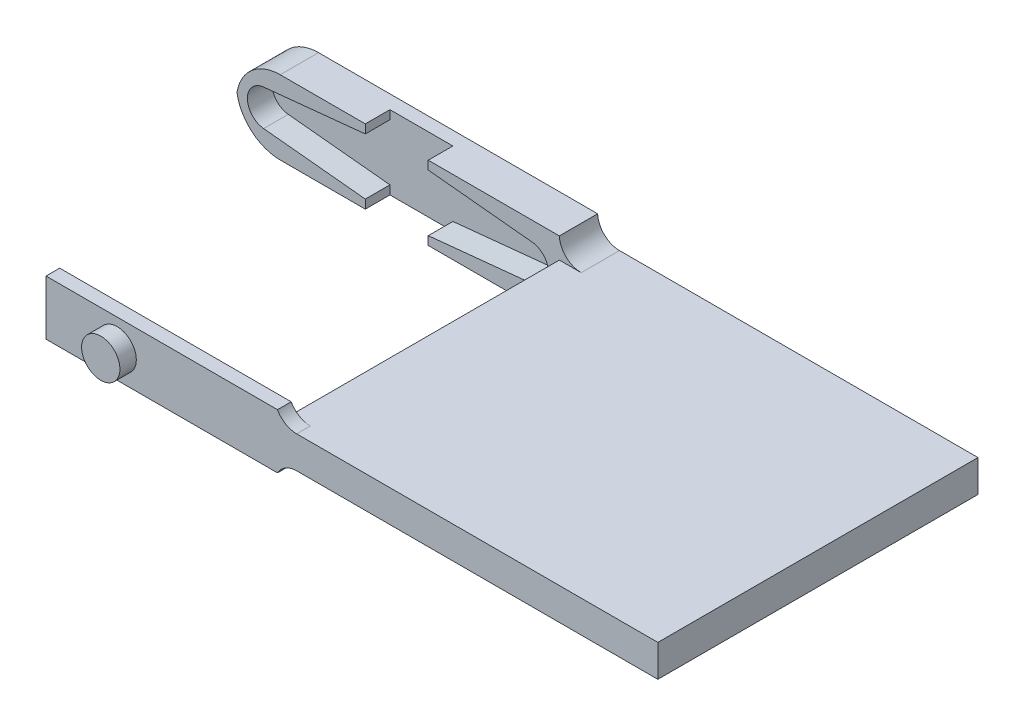
ISO-10303-21;
HEADER;
FILE_DESCRIPTION(('STEP AP214'),'2;1');
FILE_NAME('part.step','',(''),(''),'','','');
FILE_SCHEMA(('AUTOMOTIVE_DESIGN { 1 0 10303 214 1 1 1 1 }'));
ENDSEC;
DATA;
#1=APPLICATION_CONTEXT('core data for automotive mechanical design processes');
#2=APPLICATION_PROTOCOL_DEFINITION('international standard','automotive_design',2000,#1);
#3=PRODUCT_CONTEXT('',#1,'mechanical');
#4=PRODUCT('Part','Part','',(#3));
#5=PRODUCT_RELATED_PRODUCT_CATEGORY('part','',(#4));
#6=PRODUCT_DEFINITION_FORMATION('','',#4);
#7=PRODUCT_DEFINITION_CONTEXT('part definition',#1,'design');
#8=PRODUCT_DEFINITION('design','',#6,#7);
#9=PRODUCT_DEFINITION_SHAPE('','',#8);
#10=(LENGTH_UNIT() NAMED_UNIT(*) SI_UNIT(.MILLI.,.METRE.));
#11=(NAMED_UNIT(*) PLANE_ANGLE_UNIT() SI_UNIT($,.RADIAN.));
#12=(NAMED_UNIT(*) SI_UNIT($,.STERADIAN.) SOLID_ANGLE_UNIT());
#13=UNCERTAINTY_MEASURE_WITH_UNIT(LENGTH_MEASURE(1.E-05),#10,'distance_accuracy_value','');
#14=(GEOMETRIC_REPRESENTATION_CONTEXT(3) GLOBAL_UNCERTAINTY_ASSIGNED_CONTEXT((#13)) GLOBAL_UNIT_ASSIGNED_CONTEXT((#10,
#11,#12)) REPRESENTATION_CONTEXT('',''));
#15=CARTESIAN_POINT('',(0.,0.,0.));
#16=DIRECTION('',(0.,0.,1.));
#17=DIRECTION('',(1.,0.,0.));
#18=AXIS2_PLACEMENT_3D('',#15,#16,#17);
#19=CARTESIAN_POINT('',(0.,0.,29.25));
#20=DIRECTION('',(0.,0.,1.));
#21=DIRECTION('',(1.,0.,0.));
#22=AXIS2_PLACEMENT_3D('',#19,#20,#21);
#23=PLANE('',#22);
#24=DIRECTION('',(1.,0.,0.));
#25=VECTOR('',#24,1.);
#26=CARTESIAN_POINT('',(0.,4.83707186120483,29.25));
#27=LINE('',#26,#25);
#28=CARTESIAN_POINT('',(16.5034017605437,4.83707186120483,29.25));
#29=VERTEX_POINT('',#28);
#30=CARTESIAN_POINT('',(49.5,4.83707186120483,29.25));
#31=VERTEX_POINT('',#30);
#32=EDGE_CURVE('E511',#29,#31,#27,.T.);
#33=ORIENTED_EDGE('',*,*,#32,.F.);
#34=CARTESIAN_POINT('',(16.5034017605437,6.83707186120483,29.25));
#35=DIRECTION('',(0.,0.,1.));
#36=DIRECTION('',(1.,0.,0.));
#37=AXIS2_PLACEMENT_3D('',#34,#35,#36);
#38=CIRCLE('',#37,2.);
#39=CARTESIAN_POINT('',(14.75,5.87500000000001,29.25));
#40=VERTEX_POINT('',#39);
#41=EDGE_CURVE('E447',#29,#40,#38,.F.);
#42=ORIENTED_EDGE('',*,*,#41,.T.);
#43=DIRECTION('',(1.,0.,0.));
#44=VECTOR('',#43,1.);
#45=CARTESIAN_POINT('',(0.,5.87500000000001,29.25));
#46=LINE('',#45,#44);
#47=CARTESIAN_POINT('',(-6.4,5.875,29.25));
#48=VERTEX_POINT('',#47);
#49=EDGE_CURVE('E472',#48,#40,#46,.T.);
#50=ORIENTED_EDGE('',*,*,#49,.F.);
#51=DIRECTION('',(0.,-1.,0.));
#52=VECTOR('',#51,1.);
#53=CARTESIAN_POINT('',(-6.4,0.,29.25));
#54=LINE('',#53,#52);
#55=CARTESIAN_POINT('',(-6.4,0.875000000000003,29.25));
#56=VERTEX_POINT('',#55);
#57=EDGE_CURVE('E475',#48,#56,#54,.T.);
#58=ORIENTED_EDGE('',*,*,#57,.T.);
#59=DIRECTION('',(1.,0.,0.));
#60=VECTOR('',#59,1.);
#61=CARTESIAN_POINT('',(0.,0.875000000000003,29.25));
#62=LINE('',#61,#60);
#63=CARTESIAN_POINT('',(14.75,0.875000000000003,29.25));
#64=VERTEX_POINT('',#63);
#65=EDGE_CURVE('E490',#56,#64,#62,.T.);
#66=ORIENTED_EDGE('',*,*,#65,.T.);
#67=CARTESIAN_POINT('',(16.5034017605437,-0.0870718612048299,29.25));
#68=DIRECTION('',(0.,0.,1.));
#69=DIRECTION('',(1.,0.,0.));
#70=AXIS2_PLACEMENT_3D('',#67,#68,#69);
#71=CIRCLE('',#70,2.);
#72=CARTESIAN_POINT('',(16.5034017605437,1.91292813879517,29.25));
#73=VERTEX_POINT('',#72);
#74=EDGE_CURVE('E451',#64,#73,#71,.F.);
#75=ORIENTED_EDGE('',*,*,#74,.T.);
#76=DIRECTION('',(1.,0.,0.));
#77=VECTOR('',#76,1.);
#78=CARTESIAN_POINT('',(0.,1.91292813879517,29.25));
#79=LINE('',#78,#77);
#80=CARTESIAN_POINT('',(49.5,1.91292813879517,29.25));
#81=VERTEX_POINT('',#80);
#82=EDGE_CURVE('E513',#73,#81,#79,.T.);
#83=ORIENTED_EDGE('',*,*,#82,.T.);
#84=DIRECTION('',(0.,-1.,0.));
#85=VECTOR('',#84,1.);
#86=CARTESIAN_POINT('',(49.5,0.,29.25));
#87=LINE('',#86,#85);
#88=EDGE_CURVE('E515',#31,#81,#87,.T.);
#89=ORIENTED_EDGE('',*,*,#88,.F.);
#90=EDGE_LOOP('',(#33,#42,#50,#58,#66,#75,#83,#89));
#91=FACE_BOUND('',#90,.T.);
#92=CARTESIAN_POINT('',(0.102107464172212,3.37499999999922,29.25));
#93=DIRECTION('',(0.,0.,1.));
#94=DIRECTION('',(1.,0.,0.));
#95=AXIS2_PLACEMENT_3D('',#92,#93,#94);
#96=CIRCLE('',#95,1.75000000000137);
#97=CARTESIAN_POINT('',(1.85210746417358,3.37499999999922,29.25));
#98=VERTEX_POINT('',#97);
#99=EDGE_CURVE('E594',#98,#98,#96,.T.);
#100=ORIENTED_EDGE('',*,*,#99,.F.);
#101=EDGE_LOOP('',(#100));
#102=FACE_BOUND('',#101,.T.);
#103=ADVANCED_FACE('F141',(#91,#102),#23,.T.);
#104=CARTESIAN_POINT('',(0.,0.,3.5));
#105=DIRECTION('',(0.,0.,1.));
#106=DIRECTION('',(1.,0.,0.));
#107=AXIS2_PLACEMENT_3D('',#104,#105,#106);
#108=PLANE('',#107);
#109=DIRECTION('',(0.,-1.,0.));
#110=VECTOR('',#109,1.);
#111=CARTESIAN_POINT('',(-2.97710746417331,0.,3.5));
#112=LINE('',#111,#110);
#113=CARTESIAN_POINT('',(-2.97710746417331,0.799354218210046,3.5));
#114=VERTEX_POINT('',#113);
#115=CARTESIAN_POINT('',(-2.97710746417331,0.,3.5));
#116=VERTEX_POINT('',#115);
#117=EDGE_CURVE('E332',#114,#116,#112,.T.);
#118=ORIENTED_EDGE('',*,*,#117,.F.);
#119=DIRECTION('',(0.994982658758142,-0.10004753255617,0.));
#120=VECTOR('',#119,1.);
#121=CARTESIAN_POINT('',(0.0497727799724651,0.494995245614711,3.5));
#122=LINE('',#121,#120);
#123=CARTESIAN_POINT('',(-12.2650784287177,1.73327861304907,3.5));
#124=VERTEX_POINT('',#123);
#125=EDGE_CURVE('E372',#124,#114,#122,.T.);
#126=ORIENTED_EDGE('',*,*,#125,.F.);
#127=CARTESIAN_POINT('',(-12.1,3.375,3.5));
#128=DIRECTION('',(0.,0.,1.));
#129=DIRECTION('',(1.,0.,0.));
#130=AXIS2_PLACEMENT_3D('',#127,#128,#129);
#131=CIRCLE('',#130,1.65);
#132=CARTESIAN_POINT('',(-12.2650784287177,5.01672138695093,3.5));
#133=VERTEX_POINT('',#132);
#134=EDGE_CURVE('E374',#133,#124,#131,.T.);
#135=ORIENTED_EDGE('',*,*,#134,.F.);
#136=DIRECTION('',(0.994982658758143,0.100047532556171,0.));
#137=VECTOR('',#136,1.);
#138=CARTESIAN_POINT('',(-0.622159749655816,6.18744057018389,3.5));
#139=LINE('',#138,#137);
#140=CARTESIAN_POINT('',(-2.97710746417331,5.95064578178995,3.5));
#141=VERTEX_POINT('',#140);
#142=EDGE_CURVE('E377',#133,#141,#139,.T.);
#143=ORIENTED_EDGE('',*,*,#142,.T.);
#144=DIRECTION('',(0.,-1.,0.));
#145=VECTOR('',#144,1.);
#146=CARTESIAN_POINT('',(-2.97710746417331,6.74999999999965,3.5));
#147=LINE('',#146,#145);
#148=CARTESIAN_POINT('',(-2.97710746417331,6.74999999999965,3.5));
#149=VERTEX_POINT('',#148);
#150=EDGE_CURVE('E607',#149,#141,#147,.T.);
#151=ORIENTED_EDGE('',*,*,#150,.F.);
#152=DIRECTION('',(1.,0.,0.));
#153=VECTOR('',#152,1.);
#154=CARTESIAN_POINT('',(0.,6.75,3.5));
#155=LINE('',#154,#153);
#156=CARTESIAN_POINT('',(-10.75,6.75,3.5));
#157=VERTEX_POINT('',#156);
#158=EDGE_CURVE('E363',#157,#149,#155,.T.);
#159=ORIENTED_EDGE('',*,*,#158,.F.);
#160=CARTESIAN_POINT('',(-10.75,2.75,3.5));
#161=DIRECTION('',(0.,0.,1.));
#162=DIRECTION('',(1.,0.,0.));
#163=AXIS2_PLACEMENT_3D('',#160,#161,#162);
#164=CIRCLE('',#163,4.);
#165=CARTESIAN_POINT('',(-14.7008701573198,3.37499999999999,3.5));
#166=VERTEX_POINT('',#165);
#167=EDGE_CURVE('E150',#157,#166,#164,.T.);
#168=ORIENTED_EDGE('',*,*,#167,.T.);
#169=CARTESIAN_POINT('',(-10.75,4.,3.5));
#170=DIRECTION('',(0.,0.,1.));
#171=DIRECTION('',(1.,0.,0.));
#172=AXIS2_PLACEMENT_3D('',#169,#170,#171);
#173=CIRCLE('',#172,4.);
#174=CARTESIAN_POINT('',(-10.75,0.,3.5));
#175=VERTEX_POINT('',#174);
#176=EDGE_CURVE('E356',#166,#175,#173,.T.);
#177=ORIENTED_EDGE('',*,*,#176,.T.);
#178=DIRECTION('',(1.,0.,0.));
#179=VECTOR('',#178,1.);
#180=CARTESIAN_POINT('',(0.,0.,3.5));
#181=LINE('',#180,#179);
#182=EDGE_CURVE('E349',#175,#116,#181,.T.);
#183=ORIENTED_EDGE('',*,*,#182,.T.);
#184=EDGE_LOOP('',(#118,#126,#135,#143,#151,#159,#168,#177,#183));
#185=FACE_BOUND('',#184,.T.);
#186=ADVANCED_FACE('F354',(#185),#108,.T.);
#187=CARTESIAN_POINT('',(14.75,0.,29.25));
#188=DIRECTION('',(1.,0.,0.));
#189=DIRECTION('',(0.,1.,0.));
#190=AXIS2_PLACEMENT_3D('',#187,#188,#189);
#191=PLANE('',#190);
#192=DIRECTION('',(0.,-1.,0.));
#193=VECTOR('',#192,1.);
#194=CARTESIAN_POINT('',(14.75,0.,28.));
#195=LINE('',#194,#193);
#196=CARTESIAN_POINT('',(14.75,4.83707186120483,28.));
#197=VERTEX_POINT('',#196);
#198=CARTESIAN_POINT('',(14.75,1.91292813879517,28.));
#199=VERTEX_POINT('',#198);
#200=EDGE_CURVE('E486',#197,#199,#195,.T.);
#201=ORIENTED_EDGE('',*,*,#200,.F.);
#202=DIRECTION('',(0.,0.,-1.));
#203=VECTOR('',#202,1.);
#204=CARTESIAN_POINT('',(14.75,4.83707186120483,29.25));
#205=LINE('',#204,#203);
#206=CARTESIAN_POINT('',(14.75,4.83707186120483,3.5));
#207=VERTEX_POINT('',#206);
#208=EDGE_CURVE('E529',#197,#207,#205,.T.);
#209=ORIENTED_EDGE('',*,*,#208,.T.);
#210=DIRECTION('',(0.,-1.,0.));
#211=VECTOR('',#210,1.);
#212=CARTESIAN_POINT('',(14.75,0.,3.5));
#213=LINE('',#212,#211);
#214=CARTESIAN_POINT('',(14.75,1.91292813879517,3.5));
#215=VERTEX_POINT('',#214);
#216=EDGE_CURVE('E386',#207,#215,#213,.T.);
#217=ORIENTED_EDGE('',*,*,#216,.T.);
#218=DIRECTION('',(0.,0.,-1.));
#219=VECTOR('',#218,1.);
#220=CARTESIAN_POINT('',(14.75,1.91292813879517,29.25));
#221=LINE('',#220,#219);
#222=EDGE_CURVE('E526',#199,#215,#221,.T.);
#223=ORIENTED_EDGE('',*,*,#222,.F.);
#224=EDGE_LOOP('',(#201,#209,#217,#223));
#225=FACE_BOUND('',#224,.T.);
#226=ADVANCED_FACE('F649',(#225),#191,.F.);
#227=CARTESIAN_POINT('',(0.622159749655816,6.18744057018389,3.5));
#228=DIRECTION('',(-0.100047532556171,-0.994982658758142,0.));
#229=DIRECTION('',(0.994982658758142,-0.100047532556171,0.));
#230=AXIS2_PLACEMENT_3D('',#227,#228,#229);
#231=PLANE('',#230);
#232=DIRECTION('',(0.,0.,1.));
#233=VECTOR('',#232,1.);
#234=CARTESIAN_POINT('',(2.77289253582693,5.97118000870572,3.5));
#235=LINE('',#234,#233);
#236=CARTESIAN_POINT('',(2.77289253582693,5.97118000870572,1.24999999999997));
#237=VERTEX_POINT('',#236);
#238=CARTESIAN_POINT('',(2.77289253582693,5.97118000870572,3.5));
#239=VERTEX_POINT('',#238);
#240=EDGE_CURVE('E165',#237,#239,#235,.T.);
#241=ORIENTED_EDGE('',*,*,#240,.F.);
#242=DIRECTION('',(-0.994982658758143,0.100047532556171,0.));
#243=VECTOR('',#242,1.);
#244=CARTESIAN_POINT('',(0.622159749655816,6.18744057018389,1.25));
#245=LINE('',#244,#243);
#246=CARTESIAN_POINT('',(12.2650784287177,5.01672138695093,1.25));
#247=VERTEX_POINT('',#246);
#248=EDGE_CURVE('E535',#247,#237,#245,.T.);
#249=ORIENTED_EDGE('',*,*,#248,.F.);
#250=DIRECTION('',(0.,0.,-1.));
#251=VECTOR('',#250,1.);
#252=CARTESIAN_POINT('',(12.2650784287177,5.01672138695093,3.5));
#253=LINE('',#252,#251);
#254=CARTESIAN_POINT('',(12.2650784287177,5.01672138695093,3.5));
#255=VERTEX_POINT('',#254);
#256=EDGE_CURVE('E397',#255,#247,#253,.T.);
#257=ORIENTED_EDGE('',*,*,#256,.F.);
#258=DIRECTION('',(-0.994982658758143,0.100047532556171,0.));
#259=VECTOR('',#258,1.);
#260=CARTESIAN_POINT('',(0.622159749655816,6.18744057018389,3.5));
#261=LINE('',#260,#259);
#262=EDGE_CURVE('E357',#255,#239,#261,.T.);
#263=ORIENTED_EDGE('',*,*,#262,.T.);
#264=EDGE_LOOP('',(#241,#249,#257,#263));
#265=FACE_BOUND('',#264,.T.);
#266=ADVANCED_FACE('F664',(#265),#231,.T.);
#267=CARTESIAN_POINT('',(12.1,3.375,3.5));
#268=DIRECTION('',(0.,0.,-1.));
#269=DIRECTION('',(-1.,0.,0.));
#270=AXIS2_PLACEMENT_3D('',#267,#268,#269);
#271=CYLINDRICAL_SURFACE('',#270,1.64999999999999);
#272=ORIENTED_EDGE('',*,*,#256,.T.);
#273=CARTESIAN_POINT('',(12.1,3.375,1.25));
#274=DIRECTION('',(0.,0.,1.));
#275=DIRECTION('',(1.,0.,0.));
#276=AXIS2_PLACEMENT_3D('',#273,#274,#275);
#277=CIRCLE('',#276,1.64999999999999);
#278=CARTESIAN_POINT('',(12.2650784287177,1.73327861304907,1.25));
#279=VERTEX_POINT('',#278);
#280=EDGE_CURVE('E532',#247,#279,#277,.F.);
#281=ORIENTED_EDGE('',*,*,#280,.T.);
#282=DIRECTION('',(0.,0.,-1.));
#283=VECTOR('',#282,1.);
#284=CARTESIAN_POINT('',(12.2650784287177,1.73327861304907,3.5));
#285=LINE('',#284,#283);
#286=CARTESIAN_POINT('',(12.2650784287177,1.73327861304907,3.5));
#287=VERTEX_POINT('',#286);
#288=EDGE_CURVE('E394',#287,#279,#285,.T.);
#289=ORIENTED_EDGE('',*,*,#288,.F.);
#290=CARTESIAN_POINT('',(12.1,3.375,3.5));
#291=DIRECTION('',(0.,0.,1.));
#292=DIRECTION('',(1.,0.,0.));
#293=AXIS2_PLACEMENT_3D('',#290,#291,#292);
#294=CIRCLE('',#293,1.64999999999999);
#295=EDGE_CURVE('E361',#255,#287,#294,.F.);
#296=ORIENTED_EDGE('',*,*,#295,.F.);
#297=EDGE_LOOP('',(#272,#281,#289,#296));
#298=FACE_BOUND('',#297,.T.);
#299=ADVANCED_FACE('F640',(#298),#271,.F.);
#300=CARTESIAN_POINT('',(-0.0497727799724653,0.49499524561471,3.5));
#301=DIRECTION('',(0.100047532556171,-0.994982658758142,0.));
#302=DIRECTION('',(0.994982658758143,0.100047532556171,0.));
#303=AXIS2_PLACEMENT_3D('',#300,#301,#302);
#304=PLANE('',#303);
#305=DIRECTION('',(-0.994982658758142,-0.100047532556171,0.));
#306=VECTOR('',#305,1.);
#307=CARTESIAN_POINT('',(-0.0497727799724653,0.49499524561471,1.25));
#308=LINE('',#307,#306);
#309=CARTESIAN_POINT('',(2.77289253582694,0.778819991294283,1.24999999999997));
#310=VERTEX_POINT('',#309);
#311=EDGE_CURVE('E384',#279,#310,#308,.T.);
#312=ORIENTED_EDGE('',*,*,#311,.T.);
#313=DIRECTION('',(0.,0.,1.));
#314=VECTOR('',#313,1.);
#315=CARTESIAN_POINT('',(2.77289253582694,0.778819991294283,3.5));
#316=LINE('',#315,#314);
#317=CARTESIAN_POINT('',(2.77289253582694,0.778819991294283,3.5));
#318=VERTEX_POINT('',#317);
#319=EDGE_CURVE('E601',#310,#318,#316,.T.);
#320=ORIENTED_EDGE('',*,*,#319,.T.);
#321=DIRECTION('',(-0.994982658758142,-0.100047532556171,0.));
#322=VECTOR('',#321,1.);
#323=CARTESIAN_POINT('',(-0.0497727799724653,0.49499524561471,3.5));
#324=LINE('',#323,#322);
#325=EDGE_CURVE('E369',#287,#318,#324,.T.);
#326=ORIENTED_EDGE('',*,*,#325,.F.);
#327=ORIENTED_EDGE('',*,*,#288,.T.);
#328=EDGE_LOOP('',(#312,#320,#326,#327));
#329=FACE_BOUND('',#328,.T.);
#330=ADVANCED_FACE('F633',(#329),#304,.F.);
#331=CARTESIAN_POINT('',(0.0497727799724651,0.494995245614711,3.5));
#332=DIRECTION('',(0.10004753255617,0.994982658758143,0.));
#333=DIRECTION('',(-0.994982658758143,0.10004753255617,0.));
#334=AXIS2_PLACEMENT_3D('',#331,#332,#333);
#335=PLANE('',#334);
#336=DIRECTION('',(0.,0.,1.));
#337=VECTOR('',#336,1.);
#338=CARTESIAN_POINT('',(-2.97710746417331,0.799354218210046,3.5));
#339=LINE('',#338,#337);
#340=CARTESIAN_POINT('',(-2.97710746417331,0.799354218210046,1.24999999999997));
#341=VERTEX_POINT('',#340);
#342=EDGE_CURVE('E338',#341,#114,#339,.T.);
#343=ORIENTED_EDGE('',*,*,#342,.F.);
#344=DIRECTION('',(0.994982658758142,-0.10004753255617,0.));
#345=VECTOR('',#344,1.);
#346=CARTESIAN_POINT('',(0.0497727799724651,0.494995245614711,1.25));
#347=LINE('',#346,#345);
#348=CARTESIAN_POINT('',(-12.2650784287177,1.73327861304907,1.25));
#349=VERTEX_POINT('',#348);
#350=EDGE_CURVE('E542',#349,#341,#347,.T.);
#351=ORIENTED_EDGE('',*,*,#350,.F.);
#352=DIRECTION('',(0.,0.,-1.));
#353=VECTOR('',#352,1.);
#354=CARTESIAN_POINT('',(-12.2650784287177,1.73327861304907,3.5));
#355=LINE('',#354,#353);
#356=EDGE_CURVE('E390',#124,#349,#355,.T.);
#357=ORIENTED_EDGE('',*,*,#356,.F.);
#358=ORIENTED_EDGE('',*,*,#125,.T.);
#359=EDGE_LOOP('',(#343,#351,#357,#358));
#360=FACE_BOUND('',#359,.T.);
#361=ADVANCED_FACE('F631',(#360),#335,.T.);
#362=CARTESIAN_POINT('',(-12.1,3.375,3.5));
#363=DIRECTION('',(0.,0.,-1.));
#364=DIRECTION('',(-1.,0.,0.));
#365=AXIS2_PLACEMENT_3D('',#362,#363,#364);
#366=CYLINDRICAL_SURFACE('',#365,1.65);
#367=CARTESIAN_POINT('',(-12.1,3.375,1.25));
#368=DIRECTION('',(0.,0.,1.));
#369=DIRECTION('',(1.,0.,0.));
#370=AXIS2_PLACEMENT_3D('',#367,#368,#369);
#371=CIRCLE('',#370,1.65);
#372=CARTESIAN_POINT('',(-12.2650784287177,5.01672138695093,1.25));
#373=VERTEX_POINT('',#372);
#374=EDGE_CURVE('E540',#373,#349,#371,.T.);
#375=ORIENTED_EDGE('',*,*,#374,.F.);
#376=DIRECTION('',(0.,0.,-1.));
#377=VECTOR('',#376,1.);
#378=CARTESIAN_POINT('',(-12.2650784287177,5.01672138695093,3.5));
#379=LINE('',#378,#377);
#380=EDGE_CURVE('E387',#133,#373,#379,.T.);
#381=ORIENTED_EDGE('',*,*,#380,.F.);
#382=ORIENTED_EDGE('',*,*,#134,.T.);
#383=ORIENTED_EDGE('',*,*,#356,.T.);
#384=EDGE_LOOP('',(#375,#381,#382,#383));
#385=FACE_BOUND('',#384,.T.);
#386=ADVANCED_FACE('F626',(#385),#366,.F.);
#387=CARTESIAN_POINT('',(0.,6.75,3.5));
#388=DIRECTION('',(0.,1.,0.));
#389=DIRECTION('',(0.,0.,1.));
#390=AXIS2_PLACEMENT_3D('',#387,#388,#389);
#391=PLANE('',#390);
#392=DIRECTION('',(0.,0.,1.));
#393=VECTOR('',#392,1.);
#394=CARTESIAN_POINT('',(-2.97710746417331,6.74999999999965,-4.60902082262923));
#395=LINE('',#394,#393);
#396=CARTESIAN_POINT('',(-2.97710746417331,6.74999999999965,1.24999999999997));
#397=VERTEX_POINT('',#396);
#398=EDGE_CURVE('E482',#397,#149,#395,.T.);
#399=ORIENTED_EDGE('',*,*,#398,.F.);
#400=DIRECTION('',(-1.,0.,0.));
#401=VECTOR('',#400,1.);
#402=CARTESIAN_POINT('',(-2.97710746417331,6.74999999999965,1.24999999999997));
#403=LINE('',#402,#401);
#404=CARTESIAN_POINT('',(2.77289253582693,6.74999999999963,1.24999999999997));
#405=VERTEX_POINT('',#404);
#406=EDGE_CURVE('E615',#405,#397,#403,.T.);
#407=ORIENTED_EDGE('',*,*,#406,.F.);
#408=DIRECTION('',(0.,0.,1.));
#409=VECTOR('',#408,1.);
#410=CARTESIAN_POINT('',(2.77289253582693,6.74999999999963,-4.60902082262923));
#411=LINE('',#410,#409);
#412=CARTESIAN_POINT('',(2.77289253582693,6.74999999999963,3.5));
#413=VERTEX_POINT('',#412);
#414=EDGE_CURVE('E618',#405,#413,#411,.T.);
#415=ORIENTED_EDGE('',*,*,#414,.T.);
#416=CARTESIAN_POINT('',(14.75,6.75,3.5));
#417=VERTEX_POINT('',#416);
#418=EDGE_CURVE('E547',#413,#417,#155,.T.);
#419=ORIENTED_EDGE('',*,*,#418,.T.);
#420=DIRECTION('',(0.,0.,-1.));
#421=VECTOR('',#420,1.);
#422=CARTESIAN_POINT('',(14.75,6.75,3.5));
#423=LINE('',#422,#421);
#424=CARTESIAN_POINT('',(14.75,6.75,0.));
#425=VERTEX_POINT('',#424);
#426=EDGE_CURVE('E391',#417,#425,#423,.T.);
#427=ORIENTED_EDGE('',*,*,#426,.T.);
#428=DIRECTION('',(1.,0.,0.));
#429=VECTOR('',#428,1.);
#430=CARTESIAN_POINT('',(0.,6.75,0.));
#431=LINE('',#430,#429);
#432=CARTESIAN_POINT('',(-10.75,6.75,0.));
#433=VERTEX_POINT('',#432);
#434=EDGE_CURVE('E381',#433,#425,#431,.T.);
#435=ORIENTED_EDGE('',*,*,#434,.F.);
#436=DIRECTION('',(0.,0.,-1.));
#437=VECTOR('',#436,1.);
#438=CARTESIAN_POINT('',(-10.75,6.75,3.5));
#439=LINE('',#438,#437);
#440=EDGE_CURVE('E457',#433,#157,#439,.F.);
#441=ORIENTED_EDGE('',*,*,#440,.T.);
#442=ORIENTED_EDGE('',*,*,#158,.T.);
#443=EDGE_LOOP('',(#399,#407,#415,#419,#427,#435,#441,#442));
#444=FACE_BOUND('',#443,.T.);
#445=ADVANCED_FACE('F555',(#444),#391,.T.);
#446=CARTESIAN_POINT('',(0.,0.,3.5));
#447=DIRECTION('',(0.,1.,0.));
#448=DIRECTION('',(0.,0.,1.));
#449=AXIS2_PLACEMENT_3D('',#446,#447,#448);
#450=PLANE('',#449);
#451=DIRECTION('',(1.,0.,0.));
#452=VECTOR('',#451,1.);
#453=CARTESIAN_POINT('',(-2.97710746417331,0.,1.24999999999997));
#454=LINE('',#453,#452);
#455=CARTESIAN_POINT('',(-2.97710746417331,0.,1.24999999999997));
#456=VERTEX_POINT('',#455);
#457=CARTESIAN_POINT('',(2.77289253582694,0.,1.24999999999997));
#458=VERTEX_POINT('',#457);
#459=EDGE_CURVE('E352',#456,#458,#454,.T.);
#460=ORIENTED_EDGE('',*,*,#459,.F.);
#461=DIRECTION('',(0.,0.,1.));
#462=VECTOR('',#461,1.);
#463=CARTESIAN_POINT('',(-2.97710746417331,0.,-4.60902082262923));
#464=LINE('',#463,#462);
#465=EDGE_CURVE('E335',#456,#116,#464,.T.);
#466=ORIENTED_EDGE('',*,*,#465,.T.);
#467=ORIENTED_EDGE('',*,*,#182,.F.);
#468=DIRECTION('',(0.,0.,-1.));
#469=VECTOR('',#468,1.);
#470=CARTESIAN_POINT('',(-10.75,0.,0.));
#471=LINE('',#470,#469);
#472=CARTESIAN_POINT('',(-10.75,0.,0.));
#473=VERTEX_POINT('',#472);
#474=EDGE_CURVE('E12',#175,#473,#471,.T.);
#475=ORIENTED_EDGE('',*,*,#474,.T.);
#476=DIRECTION('',(1.,0.,0.));
#477=VECTOR('',#476,1.);
#478=CARTESIAN_POINT('',(0.,0.,0.));
#479=LINE('',#478,#477);
#480=CARTESIAN_POINT('',(14.75,0.,0.));
#481=VERTEX_POINT('',#480);
#482=EDGE_CURVE('E383',#473,#481,#479,.T.);
#483=ORIENTED_EDGE('',*,*,#482,.T.);
#484=DIRECTION('',(0.,0.,-1.));
#485=VECTOR('',#484,1.);
#486=CARTESIAN_POINT('',(14.75,0.,3.5));
#487=LINE('',#486,#485);
#488=CARTESIAN_POINT('',(14.75,0.,3.5));
#489=VERTEX_POINT('',#488);
#490=EDGE_CURVE('E380',#489,#481,#487,.T.);
#491=ORIENTED_EDGE('',*,*,#490,.F.);
#492=CARTESIAN_POINT('',(2.77289253582694,0.,3.5));
#493=VERTEX_POINT('',#492);
#494=EDGE_CURVE('E358',#493,#489,#181,.T.);
#495=ORIENTED_EDGE('',*,*,#494,.F.);
#496=DIRECTION('',(0.,0.,1.));
#497=VECTOR('',#496,1.);
#498=CARTESIAN_POINT('',(2.77289253582694,0.,-4.60902082262923));
#499=LINE('',#498,#497);
#500=EDGE_CURVE('E157',#458,#493,#499,.T.);
#501=ORIENTED_EDGE('',*,*,#500,.F.);
#502=EDGE_LOOP('',(#460,#466,#467,#475,#483,#491,#495,#501));
#503=FACE_BOUND('',#502,.T.);
#504=ADVANCED_FACE('F348',(#503),#450,.F.);
#505=CARTESIAN_POINT('',(-0.622159749655816,6.18744057018389,3.5));
#506=DIRECTION('',(-0.100047532556171,0.994982658758142,0.));
#507=DIRECTION('',(-0.994982658758142,-0.100047532556171,0.));
#508=AXIS2_PLACEMENT_3D('',#505,#506,#507);
#509=PLANE('',#508);
#510=DIRECTION('',(0.994982658758143,0.100047532556171,0.));
#511=VECTOR('',#510,1.);
#512=CARTESIAN_POINT('',(-0.622159749655816,6.18744057018389,1.25));
#513=LINE('',#512,#511);
#514=CARTESIAN_POINT('',(-2.97710746417331,5.95064578178995,1.24999999999997));
#515=VERTEX_POINT('',#514);
#516=EDGE_CURVE('E538',#373,#515,#513,.T.);
#517=ORIENTED_EDGE('',*,*,#516,.T.);
#518=DIRECTION('',(0.,0.,1.));
#519=VECTOR('',#518,1.);
#520=CARTESIAN_POINT('',(-2.97710746417331,5.95064578178995,3.5));
#521=LINE('',#520,#519);
#522=EDGE_CURVE('E473',#515,#141,#521,.T.);
#523=ORIENTED_EDGE('',*,*,#522,.T.);
#524=ORIENTED_EDGE('',*,*,#142,.F.);
#525=ORIENTED_EDGE('',*,*,#380,.T.);
#526=EDGE_LOOP('',(#517,#523,#524,#525));
#527=FACE_BOUND('',#526,.T.);
#528=ADVANCED_FACE('F623',(#527),#509,.F.);
#529=DIRECTION('',(0.,1.,0.));
#530=VECTOR('',#529,1.);
#531=CARTESIAN_POINT('',(2.77289253582694,0.,3.5));
#532=LINE('',#531,#530);
#533=EDGE_CURVE('E344',#493,#318,#532,.T.);
#534=ORIENTED_EDGE('',*,*,#533,.F.);
#535=ORIENTED_EDGE('',*,*,#494,.T.);
#536=CARTESIAN_POINT('',(16.7481037237807,-0.0870718612048299,3.5));
#537=DIRECTION('',(0.,0.,1.));
#538=DIRECTION('',(1.,0.,0.));
#539=AXIS2_PLACEMENT_3D('',#536,#537,#538);
#540=CIRCLE('',#539,2.);
#541=CARTESIAN_POINT('',(16.7481037237807,1.91292813879517,3.5));
#542=VERTEX_POINT('',#541);
#543=EDGE_CURVE('E443',#489,#542,#540,.F.);
#544=ORIENTED_EDGE('',*,*,#543,.T.);
#545=DIRECTION('',(1.,0.,0.));
#546=VECTOR('',#545,1.);
#547=CARTESIAN_POINT('',(0.,1.91292813879517,3.5));
#548=LINE('',#547,#546);
#549=EDGE_CURVE('E429',#215,#542,#548,.T.);
#550=ORIENTED_EDGE('',*,*,#549,.F.);
#551=ORIENTED_EDGE('',*,*,#216,.F.);
#552=DIRECTION('',(-1.,0.,0.));
#553=VECTOR('',#552,1.);
#554=CARTESIAN_POINT('',(0.,4.83707186120483,3.5));
#555=LINE('',#554,#553);
#556=CARTESIAN_POINT('',(16.7481037237807,4.83707186120483,3.5));
#557=VERTEX_POINT('',#556);
#558=EDGE_CURVE('E417',#557,#207,#555,.T.);
#559=ORIENTED_EDGE('',*,*,#558,.F.);
#560=CARTESIAN_POINT('',(16.7481037237807,6.83707186120483,3.5));
#561=DIRECTION('',(0.,0.,1.));
#562=DIRECTION('',(1.,0.,0.));
#563=AXIS2_PLACEMENT_3D('',#560,#561,#562);
#564=CIRCLE('',#563,2.);
#565=EDGE_CURVE('E437',#557,#417,#564,.F.);
#566=ORIENTED_EDGE('',*,*,#565,.T.);
#567=ORIENTED_EDGE('',*,*,#418,.F.);
#568=DIRECTION('',(0.,1.,0.));
#569=VECTOR('',#568,1.);
#570=CARTESIAN_POINT('',(2.77289253582693,6.74999999999963,3.5));
#571=LINE('',#570,#569);
#572=EDGE_CURVE('E608',#239,#413,#571,.T.);
#573=ORIENTED_EDGE('',*,*,#572,.F.);
#574=ORIENTED_EDGE('',*,*,#262,.F.);
#575=ORIENTED_EDGE('',*,*,#295,.T.);
#576=ORIENTED_EDGE('',*,*,#325,.T.);
#577=EDGE_LOOP('',(#534,#535,#544,#550,#551,#559,#566,#567,#573,#574,#575,#576));
#578=FACE_BOUND('',#577,.T.);
#579=ADVANCED_FACE('F589',(#578),#108,.T.);
#580=CARTESIAN_POINT('',(0.,0.,0.));
#581=DIRECTION('',(0.,0.,1.));
#582=DIRECTION('',(1.,0.,0.));
#583=AXIS2_PLACEMENT_3D('',#580,#581,#582);
#584=PLANE('',#583);
#585=CARTESIAN_POINT('',(-10.75,4.,0.));
#586=DIRECTION('',(0.,0.,1.));
#587=DIRECTION('',(1.,0.,0.));
#588=AXIS2_PLACEMENT_3D('',#585,#586,#587);
#589=CIRCLE('',#588,4.);
#590=CARTESIAN_POINT('',(-14.7008701573198,3.37499999999999,0.));
#591=VERTEX_POINT('',#590);
#592=EDGE_CURVE('E453',#473,#591,#589,.F.);
#593=ORIENTED_EDGE('',*,*,#592,.T.);
#594=CARTESIAN_POINT('',(-10.75,2.75,0.));
#595=DIRECTION('',(0.,0.,1.));
#596=DIRECTION('',(1.,0.,0.));
#597=AXIS2_PLACEMENT_3D('',#594,#595,#596);
#598=CIRCLE('',#597,4.);
#599=EDGE_CURVE('E455',#591,#433,#598,.F.);
#600=ORIENTED_EDGE('',*,*,#599,.T.);
#601=ORIENTED_EDGE('',*,*,#434,.T.);
#602=CARTESIAN_POINT('',(16.7481037237807,6.83707186120483,0.));
#603=DIRECTION('',(0.,0.,1.));
#604=DIRECTION('',(1.,0.,0.));
#605=AXIS2_PLACEMENT_3D('',#602,#603,#604);
#606=CIRCLE('',#605,2.);
#607=CARTESIAN_POINT('',(16.7481037237807,4.83707186120483,0.));
#608=VERTEX_POINT('',#607);
#609=EDGE_CURVE('E435',#425,#608,#606,.T.);
#610=ORIENTED_EDGE('',*,*,#609,.T.);
#611=DIRECTION('',(1.,0.,0.));
#612=VECTOR('',#611,1.);
#613=CARTESIAN_POINT('',(0.,4.83707186120483,0.));
#614=LINE('',#613,#612);
#615=CARTESIAN_POINT('',(49.5,4.83707186120483,0.));
#616=VERTEX_POINT('',#615);
#617=EDGE_CURVE('E409',#608,#616,#614,.T.);
#618=ORIENTED_EDGE('',*,*,#617,.T.);
#619=DIRECTION('',(0.,-1.,0.));
#620=VECTOR('',#619,1.);
#621=CARTESIAN_POINT('',(49.5,0.,0.));
#622=LINE('',#621,#620);
#623=CARTESIAN_POINT('',(49.5,1.91292813879517,0.));
#624=VERTEX_POINT('',#623);
#625=EDGE_CURVE('E424',#616,#624,#622,.T.);
#626=ORIENTED_EDGE('',*,*,#625,.T.);
#627=DIRECTION('',(1.,0.,0.));
#628=VECTOR('',#627,1.);
#629=CARTESIAN_POINT('',(0.,1.91292813879517,0.));
#630=LINE('',#629,#628);
#631=CARTESIAN_POINT('',(16.7481037237807,1.91292813879517,0.));
#632=VERTEX_POINT('',#631);
#633=EDGE_CURVE('E411',#632,#624,#630,.T.);
#634=ORIENTED_EDGE('',*,*,#633,.F.);
#635=CARTESIAN_POINT('',(16.7481037237807,-0.0870718612048299,0.));
#636=DIRECTION('',(0.,0.,1.));
#637=DIRECTION('',(1.,0.,0.));
#638=AXIS2_PLACEMENT_3D('',#635,#636,#637);
#639=CIRCLE('',#638,2.);
#640=EDGE_CURVE('E440',#632,#481,#639,.T.);
#641=ORIENTED_EDGE('',*,*,#640,.T.);
#642=ORIENTED_EDGE('',*,*,#482,.F.);
#643=EDGE_LOOP('',(#593,#600,#601,#610,#618,#626,#634,#641,#642));
#644=FACE_BOUND('',#643,.T.);
#645=ADVANCED_FACE('F561',(#644),#584,.F.);
#646=CARTESIAN_POINT('',(0.,0.,1.25));
#647=DIRECTION('',(0.,0.,1.));
#648=DIRECTION('',(1.,0.,0.));
#649=AXIS2_PLACEMENT_3D('',#646,#647,#648);
#650=PLANE('',#649);
#651=ORIENTED_EDGE('',*,*,#350,.T.);
#652=DIRECTION('',(0.,-1.,0.));
#653=VECTOR('',#652,1.);
#654=CARTESIAN_POINT('',(-2.97710746417331,0.,1.24999999999997));
#655=LINE('',#654,#653);
#656=EDGE_CURVE('E343',#341,#456,#655,.T.);
#657=ORIENTED_EDGE('',*,*,#656,.T.);
#658=ORIENTED_EDGE('',*,*,#459,.T.);
#659=DIRECTION('',(0.,1.,0.));
#660=VECTOR('',#659,1.);
#661=CARTESIAN_POINT('',(2.77289253582694,0.,1.24999999999997));
#662=LINE('',#661,#660);
#663=EDGE_CURVE('E598',#458,#310,#662,.T.);
#664=ORIENTED_EDGE('',*,*,#663,.T.);
#665=ORIENTED_EDGE('',*,*,#311,.F.);
#666=ORIENTED_EDGE('',*,*,#280,.F.);
#667=ORIENTED_EDGE('',*,*,#248,.T.);
#668=DIRECTION('',(0.,1.,0.));
#669=VECTOR('',#668,1.);
#670=CARTESIAN_POINT('',(2.77289253582693,6.74999999999963,1.24999999999997));
#671=LINE('',#670,#669);
#672=EDGE_CURVE('E614',#237,#405,#671,.T.);
#673=ORIENTED_EDGE('',*,*,#672,.T.);
#674=ORIENTED_EDGE('',*,*,#406,.T.);
#675=DIRECTION('',(0.,-1.,0.));
#676=VECTOR('',#675,1.);
#677=CARTESIAN_POINT('',(-2.97710746417331,6.74999999999965,1.24999999999997));
#678=LINE('',#677,#676);
#679=EDGE_CURVE('E610',#397,#515,#678,.T.);
#680=ORIENTED_EDGE('',*,*,#679,.T.);
#681=ORIENTED_EDGE('',*,*,#516,.F.);
#682=ORIENTED_EDGE('',*,*,#374,.T.);
#683=EDGE_LOOP('',(#651,#657,#658,#664,#665,#666,#667,#673,#674,#680,#681,#682));
#684=FACE_BOUND('',#683,.T.);
#685=ADVANCED_FACE('F629',(#684),#650,.T.);
#686=CARTESIAN_POINT('',(0.,4.83707186120483,29.25));
#687=DIRECTION('',(0.,1.,0.));
#688=DIRECTION('',(0.,0.,1.));
#689=AXIS2_PLACEMENT_3D('',#686,#687,#688);
#690=PLANE('',#689);
#691=ORIENTED_EDGE('',*,*,#617,.F.);
#692=DIRECTION('',(0.,0.,-1.));
#693=VECTOR('',#692,1.);
#694=CARTESIAN_POINT('',(16.7481037237807,4.83707186120483,3.5));
#695=LINE('',#694,#693);
#696=EDGE_CURVE('E419',#608,#557,#695,.F.);
#697=ORIENTED_EDGE('',*,*,#696,.T.);
#698=ORIENTED_EDGE('',*,*,#558,.T.);
#699=ORIENTED_EDGE('',*,*,#208,.F.);
#700=DIRECTION('',(1.,0.,0.));
#701=VECTOR('',#700,1.);
#702=CARTESIAN_POINT('',(0.,4.83707186120483,28.));
#703=LINE('',#702,#701);
#704=CARTESIAN_POINT('',(16.5034017605437,4.83707186120483,28.));
#705=VERTEX_POINT('',#704);
#706=EDGE_CURVE('E414',#197,#705,#703,.T.);
#707=ORIENTED_EDGE('',*,*,#706,.T.);
#708=DIRECTION('',(0.,0.,-1.));
#709=VECTOR('',#708,1.);
#710=CARTESIAN_POINT('',(16.5034017605437,4.83707186120483,29.25));
#711=LINE('',#710,#709);
#712=EDGE_CURVE('E400',#705,#29,#711,.F.);
#713=ORIENTED_EDGE('',*,*,#712,.T.);
#714=ORIENTED_EDGE('',*,*,#32,.T.);
#715=DIRECTION('',(0.,0.,-1.));
#716=VECTOR('',#715,1.);
#717=CARTESIAN_POINT('',(49.5,4.83707186120483,29.25));
#718=LINE('',#717,#716);
#719=EDGE_CURVE('E518',#31,#616,#718,.T.);
#720=ORIENTED_EDGE('',*,*,#719,.T.);
#721=EDGE_LOOP('',(#691,#697,#698,#699,#707,#713,#714,#720));
#722=FACE_BOUND('',#721,.T.);
#723=ADVANCED_FACE('F568',(#722),#690,.T.);
#724=CARTESIAN_POINT('',(0.,1.91292813879517,29.25));
#725=DIRECTION('',(0.,1.,0.));
#726=DIRECTION('',(0.,0.,1.));
#727=AXIS2_PLACEMENT_3D('',#724,#725,#726);
#728=PLANE('',#727);
#729=ORIENTED_EDGE('',*,*,#549,.T.);
#730=DIRECTION('',(0.,0.,1.));
#731=VECTOR('',#730,1.);
#732=CARTESIAN_POINT('',(16.7481037237807,1.91292813879517,29.25));
#733=LINE('',#732,#731);
#734=EDGE_CURVE('E432',#542,#632,#733,.F.);
#735=ORIENTED_EDGE('',*,*,#734,.T.);
#736=ORIENTED_EDGE('',*,*,#633,.T.);
#737=DIRECTION('',(0.,0.,-1.));
#738=VECTOR('',#737,1.);
#739=CARTESIAN_POINT('',(49.5,1.91292813879517,29.25));
#740=LINE('',#739,#738);
#741=EDGE_CURVE('E523',#81,#624,#740,.T.);
#742=ORIENTED_EDGE('',*,*,#741,.F.);
#743=ORIENTED_EDGE('',*,*,#82,.F.);
#744=DIRECTION('',(0.,0.,1.));
#745=VECTOR('',#744,1.);
#746=CARTESIAN_POINT('',(16.5034017605437,1.91292813879517,29.25));
#747=LINE('',#746,#745);
#748=CARTESIAN_POINT('',(16.5034017605437,1.91292813879517,28.));
#749=VERTEX_POINT('',#748);
#750=EDGE_CURVE('E426',#73,#749,#747,.F.);
#751=ORIENTED_EDGE('',*,*,#750,.T.);
#752=DIRECTION('',(-1.,0.,0.));
#753=VECTOR('',#752,1.);
#754=CARTESIAN_POINT('',(0.,1.91292813879517,28.));
#755=LINE('',#754,#753);
#756=EDGE_CURVE('E422',#749,#199,#755,.T.);
#757=ORIENTED_EDGE('',*,*,#756,.T.);
#758=ORIENTED_EDGE('',*,*,#222,.T.);
#759=EDGE_LOOP('',(#729,#735,#736,#742,#743,#751,#757,#758));
#760=FACE_BOUND('',#759,.T.);
#761=ADVANCED_FACE('F579',(#760),#728,.F.);
#762=CARTESIAN_POINT('',(49.5,0.,29.25));
#763=DIRECTION('',(1.,0.,0.));
#764=DIRECTION('',(0.,0.,-1.));
#765=AXIS2_PLACEMENT_3D('',#762,#763,#764);
#766=PLANE('',#765);
#767=ORIENTED_EDGE('',*,*,#625,.F.);
#768=ORIENTED_EDGE('',*,*,#719,.F.);
#769=ORIENTED_EDGE('',*,*,#88,.T.);
#770=ORIENTED_EDGE('',*,*,#741,.T.);
#771=EDGE_LOOP('',(#767,#768,#769,#770));
#772=FACE_BOUND('',#771,.T.);
#773=ADVANCED_FACE('F574',(#772),#766,.T.);
#774=CARTESIAN_POINT('',(-6.4,0.,28.));
#775=DIRECTION('',(-1.,0.,0.));
#776=DIRECTION('',(0.,0.,1.));
#777=AXIS2_PLACEMENT_3D('',#774,#775,#776);
#778=PLANE('',#777);
#779=ORIENTED_EDGE('',*,*,#57,.F.);
#780=DIRECTION('',(0.,0.,1.));
#781=VECTOR('',#780,1.);
#782=CARTESIAN_POINT('',(-6.4,5.875,28.));
#783=LINE('',#782,#781);
#784=CARTESIAN_POINT('',(-6.4,5.875,28.));
#785=VERTEX_POINT('',#784);
#786=EDGE_CURVE('E507',#785,#48,#783,.T.);
#787=ORIENTED_EDGE('',*,*,#786,.F.);
#788=DIRECTION('',(0.,-1.,0.));
#789=VECTOR('',#788,1.);
#790=CARTESIAN_POINT('',(-6.4,0.,28.));
#791=LINE('',#790,#789);
#792=CARTESIAN_POINT('',(-6.4,0.875000000000003,28.));
#793=VERTEX_POINT('',#792);
#794=EDGE_CURVE('E493',#785,#793,#791,.T.);
#795=ORIENTED_EDGE('',*,*,#794,.T.);
#796=DIRECTION('',(0.,0.,1.));
#797=VECTOR('',#796,1.);
#798=CARTESIAN_POINT('',(-6.4,0.875000000000003,28.));
#799=LINE('',#798,#797);
#800=EDGE_CURVE('E505',#793,#56,#799,.T.);
#801=ORIENTED_EDGE('',*,*,#800,.T.);
#802=EDGE_LOOP('',(#779,#787,#795,#801));
#803=FACE_BOUND('',#802,.T.);
#804=ADVANCED_FACE('F659',(#803),#778,.T.);
#805=CARTESIAN_POINT('',(0.,0.875000000000003,28.));
#806=DIRECTION('',(0.,-1.,0.));
#807=DIRECTION('',(1.,0.,0.));
#808=AXIS2_PLACEMENT_3D('',#805,#806,#807);
#809=PLANE('',#808);
#810=ORIENTED_EDGE('',*,*,#65,.F.);
#811=ORIENTED_EDGE('',*,*,#800,.F.);
#812=DIRECTION('',(1.,0.,0.));
#813=VECTOR('',#812,1.);
#814=CARTESIAN_POINT('',(0.,0.875000000000003,28.));
#815=LINE('',#814,#813);
#816=CARTESIAN_POINT('',(14.75,0.875000000000003,28.));
#817=VERTEX_POINT('',#816);
#818=EDGE_CURVE('E496',#793,#817,#815,.T.);
#819=ORIENTED_EDGE('',*,*,#818,.T.);
#820=DIRECTION('',(0.,0.,1.));
#821=VECTOR('',#820,1.);
#822=CARTESIAN_POINT('',(14.75,0.875000000000003,28.));
#823=LINE('',#822,#821);
#824=EDGE_CURVE('E412',#817,#64,#823,.T.);
#825=ORIENTED_EDGE('',*,*,#824,.T.);
#826=EDGE_LOOP('',(#810,#811,#819,#825));
#827=FACE_BOUND('',#826,.T.);
#828=ADVANCED_FACE('F735',(#827),#809,.T.);
#829=CARTESIAN_POINT('',(0.,5.87500000000001,28.));
#830=DIRECTION('',(0.,-1.,0.));
#831=DIRECTION('',(1.,0.,0.));
#832=AXIS2_PLACEMENT_3D('',#829,#830,#831);
#833=PLANE('',#832);
#834=ORIENTED_EDGE('',*,*,#49,.T.);
#835=DIRECTION('',(0.,0.,1.));
#836=VECTOR('',#835,1.);
#837=CARTESIAN_POINT('',(14.75,5.87500000000001,28.));
#838=LINE('',#837,#836);
#839=CARTESIAN_POINT('',(14.75,5.87500000000001,28.));
#840=VERTEX_POINT('',#839);
#841=EDGE_CURVE('E498',#840,#40,#838,.T.);
#842=ORIENTED_EDGE('',*,*,#841,.F.);
#843=DIRECTION('',(1.,0.,0.));
#844=VECTOR('',#843,1.);
#845=CARTESIAN_POINT('',(0.,5.87500000000001,28.));
#846=LINE('',#845,#844);
#847=EDGE_CURVE('E489',#785,#840,#846,.T.);
#848=ORIENTED_EDGE('',*,*,#847,.F.);
#849=ORIENTED_EDGE('',*,*,#786,.T.);
#850=EDGE_LOOP('',(#834,#842,#848,#849));
#851=FACE_BOUND('',#850,.T.);
#852=ADVANCED_FACE('F655',(#851),#833,.F.);
#853=CARTESIAN_POINT('',(0.,0.,28.));
#854=DIRECTION('',(0.,0.,1.));
#855=DIRECTION('',(1.,0.,0.));
#856=AXIS2_PLACEMENT_3D('',#853,#854,#855);
#857=PLANE('',#856);
#858=ORIENTED_EDGE('',*,*,#847,.T.);
#859=CARTESIAN_POINT('',(16.5034017605437,6.83707186120483,28.));
#860=DIRECTION('',(0.,0.,1.));
#861=DIRECTION('',(1.,0.,0.));
#862=AXIS2_PLACEMENT_3D('',#859,#860,#861);
#863=CIRCLE('',#862,2.);
#864=EDGE_CURVE('E445',#840,#705,#863,.T.);
#865=ORIENTED_EDGE('',*,*,#864,.T.);
#866=ORIENTED_EDGE('',*,*,#706,.F.);
#867=ORIENTED_EDGE('',*,*,#200,.T.);
#868=ORIENTED_EDGE('',*,*,#756,.F.);
#869=CARTESIAN_POINT('',(16.5034017605437,-0.0870718612048299,28.));
#870=DIRECTION('',(0.,0.,1.));
#871=DIRECTION('',(1.,0.,0.));
#872=AXIS2_PLACEMENT_3D('',#869,#870,#871);
#873=CIRCLE('',#872,2.);
#874=EDGE_CURVE('E449',#749,#817,#873,.T.);
#875=ORIENTED_EDGE('',*,*,#874,.T.);
#876=ORIENTED_EDGE('',*,*,#818,.F.);
#877=ORIENTED_EDGE('',*,*,#794,.F.);
#878=EDGE_LOOP('',(#858,#865,#866,#867,#868,#875,#876,#877));
#879=FACE_BOUND('',#878,.T.);
#880=ADVANCED_FACE('F686',(#879),#857,.F.);
#881=CARTESIAN_POINT('',(16.7481037237807,6.83707186120483,3.5));
#882=DIRECTION('',(0.,0.,1.));
#883=DIRECTION('',(1.,0.,0.));
#884=AXIS2_PLACEMENT_3D('',#881,#882,#883);
#885=CYLINDRICAL_SURFACE('',#884,2.);
#886=ORIENTED_EDGE('',*,*,#565,.F.);
#887=ORIENTED_EDGE('',*,*,#696,.F.);
#888=ORIENTED_EDGE('',*,*,#609,.F.);
#889=ORIENTED_EDGE('',*,*,#426,.F.);
#890=EDGE_LOOP('',(#886,#887,#888,#889));
#891=FACE_BOUND('',#890,.T.);
#892=ADVANCED_FACE('F566',(#891),#885,.F.);
#893=CARTESIAN_POINT('',(16.7481037237807,-0.0870718612048299,3.5));
#894=DIRECTION('',(0.,0.,1.));
#895=DIRECTION('',(1.,0.,0.));
#896=AXIS2_PLACEMENT_3D('',#893,#894,#895);
#897=CYLINDRICAL_SURFACE('',#896,2.);
#898=ORIENTED_EDGE('',*,*,#543,.F.);
#899=ORIENTED_EDGE('',*,*,#490,.T.);
#900=ORIENTED_EDGE('',*,*,#640,.F.);
#901=ORIENTED_EDGE('',*,*,#734,.F.);
#902=EDGE_LOOP('',(#898,#899,#900,#901));
#903=FACE_BOUND('',#902,.T.);
#904=ADVANCED_FACE('F584',(#903),#897,.F.);
#905=CARTESIAN_POINT('',(16.5034017605437,6.83707186120483,28.));
#906=DIRECTION('',(0.,0.,1.));
#907=DIRECTION('',(1.,0.,0.));
#908=AXIS2_PLACEMENT_3D('',#905,#906,#907);
#909=CYLINDRICAL_SURFACE('',#908,2.);
#910=ORIENTED_EDGE('',*,*,#41,.F.);
#911=ORIENTED_EDGE('',*,*,#712,.F.);
#912=ORIENTED_EDGE('',*,*,#864,.F.);
#913=ORIENTED_EDGE('',*,*,#841,.T.);
#914=EDGE_LOOP('',(#910,#911,#912,#913));
#915=FACE_BOUND('',#914,.T.);
#916=ADVANCED_FACE('F689',(#915),#909,.F.);
#917=CARTESIAN_POINT('',(16.5034017605437,-0.0870718612048299,28.));
#918=DIRECTION('',(0.,0.,1.));
#919=DIRECTION('',(1.,0.,0.));
#920=AXIS2_PLACEMENT_3D('',#917,#918,#919);
#921=CYLINDRICAL_SURFACE('',#920,2.);
#922=ORIENTED_EDGE('',*,*,#74,.F.);
#923=ORIENTED_EDGE('',*,*,#824,.F.);
#924=ORIENTED_EDGE('',*,*,#874,.F.);
#925=ORIENTED_EDGE('',*,*,#750,.F.);
#926=EDGE_LOOP('',(#922,#923,#924,#925));
#927=FACE_BOUND('',#926,.T.);
#928=ADVANCED_FACE('F692',(#927),#921,.F.);
#929=CARTESIAN_POINT('',(-10.75,4.,3.5));
#930=DIRECTION('',(0.,0.,1.));
#931=DIRECTION('',(1.,0.,0.));
#932=AXIS2_PLACEMENT_3D('',#929,#930,#931);
#933=CYLINDRICAL_SURFACE('',#932,4.);
#934=ORIENTED_EDGE('',*,*,#474,.F.);
#935=ORIENTED_EDGE('',*,*,#176,.F.);
#936=DIRECTION('',(0.,0.,1.));
#937=VECTOR('',#936,1.);
#938=CARTESIAN_POINT('',(-14.7008701573198,3.37499999999999,1.75));
#939=LINE('',#938,#937);
#940=EDGE_CURVE('E145',#591,#166,#939,.T.);
#941=ORIENTED_EDGE('',*,*,#940,.F.);
#942=ORIENTED_EDGE('',*,*,#592,.F.);
#943=EDGE_LOOP('',(#934,#935,#941,#942));
#944=FACE_BOUND('',#943,.T.);
#945=ADVANCED_FACE('F143',(#944),#933,.T.);
#946=CARTESIAN_POINT('',(-10.75,2.75,3.5));
#947=DIRECTION('',(0.,0.,-1.));
#948=DIRECTION('',(-1.,0.,0.));
#949=AXIS2_PLACEMENT_3D('',#946,#947,#948);
#950=CYLINDRICAL_SURFACE('',#949,4.);
#951=ORIENTED_EDGE('',*,*,#167,.F.);
#952=ORIENTED_EDGE('',*,*,#440,.F.);
#953=ORIENTED_EDGE('',*,*,#599,.F.);
#954=ORIENTED_EDGE('',*,*,#940,.T.);
#955=EDGE_LOOP('',(#951,#952,#953,#954));
#956=FACE_BOUND('',#955,.T.);
#957=ADVANCED_FACE('F471',(#956),#950,.T.);
#958=CARTESIAN_POINT('',(-2.97710746417331,6.74999999999965,-4.60902082262923));
#959=DIRECTION('',(-1.,0.,0.));
#960=DIRECTION('',(0.,-1.,0.));
#961=AXIS2_PLACEMENT_3D('',#958,#959,#960);
#962=PLANE('',#961);
#963=ORIENTED_EDGE('',*,*,#679,.F.);
#964=ORIENTED_EDGE('',*,*,#398,.T.);
#965=ORIENTED_EDGE('',*,*,#150,.T.);
#966=ORIENTED_EDGE('',*,*,#522,.F.);
#967=EDGE_LOOP('',(#963,#964,#965,#966));
#968=FACE_BOUND('',#967,.T.);
#969=ADVANCED_FACE('F621',(#968),#962,.F.);
#970=CARTESIAN_POINT('',(2.77289253582693,6.74999999999963,-4.60902082262923));
#971=DIRECTION('',(1.,0.,0.));
#972=DIRECTION('',(0.,1.,0.));
#973=AXIS2_PLACEMENT_3D('',#970,#971,#972);
#974=PLANE('',#973);
#975=ORIENTED_EDGE('',*,*,#240,.T.);
#976=ORIENTED_EDGE('',*,*,#572,.T.);
#977=ORIENTED_EDGE('',*,*,#414,.F.);
#978=ORIENTED_EDGE('',*,*,#672,.F.);
#979=EDGE_LOOP('',(#975,#976,#977,#978));
#980=FACE_BOUND('',#979,.T.);
#981=ADVANCED_FACE('F701',(#980),#974,.F.);
#982=CARTESIAN_POINT('',(2.77289253582694,0.,-4.60902082262923));
#983=DIRECTION('',(1.,0.,0.));
#984=DIRECTION('',(0.,0.,-1.));
#985=AXIS2_PLACEMENT_3D('',#982,#983,#984);
#986=PLANE('',#985);
#987=ORIENTED_EDGE('',*,*,#663,.F.);
#988=ORIENTED_EDGE('',*,*,#500,.T.);
#989=ORIENTED_EDGE('',*,*,#533,.T.);
#990=ORIENTED_EDGE('',*,*,#319,.F.);
#991=EDGE_LOOP('',(#987,#988,#989,#990));
#992=FACE_BOUND('',#991,.T.);
#993=ADVANCED_FACE('F902',(#992),#986,.F.);
#994=CARTESIAN_POINT('',(-2.97710746417331,0.,-4.60902082262923));
#995=DIRECTION('',(-1.,0.,0.));
#996=DIRECTION('',(0.,0.,1.));
#997=AXIS2_PLACEMENT_3D('',#994,#995,#996);
#998=PLANE('',#997);
#999=ORIENTED_EDGE('',*,*,#342,.T.);
#1000=ORIENTED_EDGE('',*,*,#117,.T.);
#1001=ORIENTED_EDGE('',*,*,#465,.F.);
#1002=ORIENTED_EDGE('',*,*,#656,.F.);
#1003=EDGE_LOOP('',(#999,#1000,#1001,#1002));
#1004=FACE_BOUND('',#1003,.T.);
#1005=ADVANCED_FACE('F334',(#1004),#998,.F.);
#1006=CARTESIAN_POINT('',(0.102107464172211,3.37499999999922,30.75));
#1007=DIRECTION('',(0.,0.,-1.));
#1008=DIRECTION('',(-1.,0.,0.));
#1009=AXIS2_PLACEMENT_3D('',#1006,#1007,#1008);
#1010=CYLINDRICAL_SURFACE('',#1009,1.75000000000137);
#1011=CARTESIAN_POINT('',(0.102107464172211,3.37499999999922,30.75));
#1012=DIRECTION('',(0.,0.,1.));
#1013=DIRECTION('',(1.,0.,0.));
#1014=AXIS2_PLACEMENT_3D('',#1011,#1012,#1013);
#1015=CIRCLE('',#1014,1.75000000000137);
#1016=CARTESIAN_POINT('',(1.85210746417358,3.37499999999922,30.75));
#1017=VERTEX_POINT('',#1016);
#1018=EDGE_CURVE('E591',#1017,#1017,#1015,.T.);
#1019=ORIENTED_EDGE('',*,*,#1018,.F.);
#1020=EDGE_LOOP('',(#1019));
#1021=FACE_BOUND('',#1020,.T.);
#1022=ORIENTED_EDGE('',*,*,#99,.T.);
#1023=EDGE_LOOP('',(#1022));
#1024=FACE_BOUND('',#1023,.T.);
#1025=ADVANCED_FACE('F917',(#1021,#1024),#1010,.T.);
#1026=CARTESIAN_POINT('',(0.102107464172211,3.37499999999922,30.75));
#1027=DIRECTION('',(0.,0.,1.));
#1028=DIRECTION('',(1.,0.,0.));
#1029=AXIS2_PLACEMENT_3D('',#1026,#1027,#1028);
#1030=PLANE('',#1029);
#1031=ORIENTED_EDGE('',*,*,#1018,.T.);
#1032=EDGE_LOOP('',(#1031));
#1033=FACE_BOUND('',#1032,.T.);
#1034=ADVANCED_FACE('F935',(#1033),#1030,.T.);
#1035=CLOSED_SHELL('',(#103,#186,#226,#266,#299,#330,#361,#386,#445,#504,#528,#579,#645,#685,
#723,#761,#773,#804,#828,#852,#880,#892,#904,#916,#928,#945,#957,#969,#981,#993,#1005,#1025,#1034));
#1036=MANIFOLD_SOLID_BREP('B2',#1035);
#1037=ADVANCED_BREP_SHAPE_REPRESENTATION('',(#18,#1036),#14);
#1038=SHAPE_DEFINITION_REPRESENTATION(#9,#1037);
ENDSEC;
END-ISO-10303-21;
